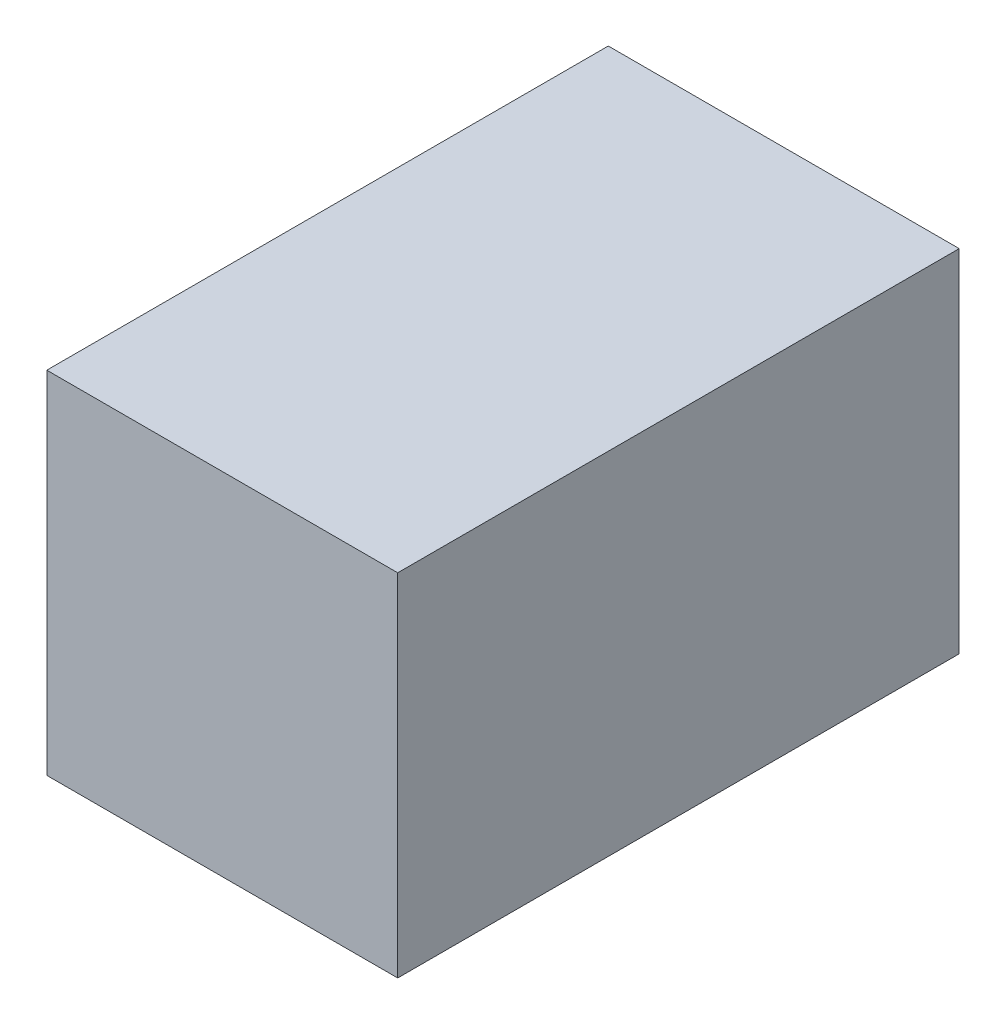
ISO-10303-21;
HEADER;
FILE_DESCRIPTION(('STEP AP214'),'2;1');
FILE_NAME('part.step','',(''),(''),'','','');
FILE_SCHEMA(('AUTOMOTIVE_DESIGN { 1 0 10303 214 1 1 1 1 }'));
ENDSEC;
DATA;
#1=APPLICATION_CONTEXT('core data for automotive mechanical design processes');
#2=APPLICATION_PROTOCOL_DEFINITION('international standard','automotive_design',2000,#1);
#3=PRODUCT_CONTEXT('',#1,'mechanical');
#4=PRODUCT('Part','Part','',(#3));
#5=PRODUCT_RELATED_PRODUCT_CATEGORY('part','',(#4));
#6=PRODUCT_DEFINITION_FORMATION('','',#4);
#7=PRODUCT_DEFINITION_CONTEXT('part definition',#1,'design');
#8=PRODUCT_DEFINITION('design','',#6,#7);
#9=PRODUCT_DEFINITION_SHAPE('','',#8);
#10=(LENGTH_UNIT() NAMED_UNIT(*) SI_UNIT(.MILLI.,.METRE.));
#11=(NAMED_UNIT(*) PLANE_ANGLE_UNIT() SI_UNIT($,.RADIAN.));
#12=(NAMED_UNIT(*) SI_UNIT($,.STERADIAN.) SOLID_ANGLE_UNIT());
#13=UNCERTAINTY_MEASURE_WITH_UNIT(LENGTH_MEASURE(1.E-05),#10,'distance_accuracy_value','');
#14=(GEOMETRIC_REPRESENTATION_CONTEXT(3) GLOBAL_UNCERTAINTY_ASSIGNED_CONTEXT((#13)) GLOBAL_UNIT_ASSIGNED_CONTEXT((#10,
#11,#12)) REPRESENTATION_CONTEXT('',''));
#15=CARTESIAN_POINT('',(0.,0.,0.));
#16=DIRECTION('',(0.,0.,1.));
#17=DIRECTION('',(1.,0.,0.));
#18=AXIS2_PLACEMENT_3D('',#15,#16,#17);
#19=CARTESIAN_POINT('',(0.5,1.,-0.800000000000001));
#20=DIRECTION('',(-1.,0.,0.));
#21=DIRECTION('',(0.,0.,1.));
#22=AXIS2_PLACEMENT_3D('',#19,#20,#21);
#23=PLANE('',#22);
#24=DIRECTION('',(0.,0.,-1.));
#25=VECTOR('',#24,1.);
#26=CARTESIAN_POINT('',(0.5,0.,-0.800000000000001));
#27=LINE('',#26,#25);
#28=CARTESIAN_POINT('',(0.5,0.,0.799999999999999));
#29=VERTEX_POINT('',#28);
#30=CARTESIAN_POINT('',(0.5,0.,-0.800000000000001));
#31=VERTEX_POINT('',#30);
#32=EDGE_CURVE('E98',#29,#31,#27,.T.);
#33=ORIENTED_EDGE('',*,*,#32,.T.);
#34=DIRECTION('',(0.,-1.,0.));
#35=VECTOR('',#34,1.);
#36=CARTESIAN_POINT('',(0.5,1.,-0.800000000000001));
#37=LINE('',#36,#35);
#38=CARTESIAN_POINT('',(0.5,1.,-0.800000000000001));
#39=VERTEX_POINT('',#38);
#40=EDGE_CURVE('E11',#39,#31,#37,.T.);
#41=ORIENTED_EDGE('',*,*,#40,.F.);
#42=DIRECTION('',(0.,0.,-1.));
#43=VECTOR('',#42,1.);
#44=CARTESIAN_POINT('',(0.5,1.,-0.800000000000001));
#45=LINE('',#44,#43);
#46=CARTESIAN_POINT('',(0.5,1.,0.799999999999999));
#47=VERTEX_POINT('',#46);
#48=EDGE_CURVE('E86',#47,#39,#45,.T.);
#49=ORIENTED_EDGE('',*,*,#48,.F.);
#50=DIRECTION('',(0.,-1.,0.));
#51=VECTOR('',#50,1.);
#52=CARTESIAN_POINT('',(0.5,1.,0.799999999999999));
#53=LINE('',#52,#51);
#54=EDGE_CURVE('E94',#47,#29,#53,.T.);
#55=ORIENTED_EDGE('',*,*,#54,.T.);
#56=EDGE_LOOP('',(#33,#41,#49,#55));
#57=FACE_BOUND('',#56,.T.);
#58=ADVANCED_FACE('F35',(#57),#23,.F.);
#59=CARTESIAN_POINT('',(-0.5,1.,-0.800000000000001));
#60=DIRECTION('',(0.,0.,1.));
#61=DIRECTION('',(1.,0.,0.));
#62=AXIS2_PLACEMENT_3D('',#59,#60,#61);
#63=PLANE('',#62);
#64=DIRECTION('',(-1.,0.,0.));
#65=VECTOR('',#64,1.);
#66=CARTESIAN_POINT('',(-0.5,0.,-0.800000000000001));
#67=LINE('',#66,#65);
#68=CARTESIAN_POINT('',(-0.5,0.,-0.800000000000001));
#69=VERTEX_POINT('',#68);
#70=EDGE_CURVE('E90',#31,#69,#67,.T.);
#71=ORIENTED_EDGE('',*,*,#70,.T.);
#72=DIRECTION('',(0.,-1.,0.));
#73=VECTOR('',#72,1.);
#74=CARTESIAN_POINT('',(-0.5,1.,-0.800000000000001));
#75=LINE('',#74,#73);
#76=CARTESIAN_POINT('',(-0.5,1.,-0.800000000000001));
#77=VERTEX_POINT('',#76);
#78=EDGE_CURVE('E43',#77,#69,#75,.T.);
#79=ORIENTED_EDGE('',*,*,#78,.F.);
#80=DIRECTION('',(-1.,0.,0.));
#81=VECTOR('',#80,1.);
#82=CARTESIAN_POINT('',(-0.5,1.,-0.800000000000001));
#83=LINE('',#82,#81);
#84=EDGE_CURVE('E81',#39,#77,#83,.T.);
#85=ORIENTED_EDGE('',*,*,#84,.F.);
#86=ORIENTED_EDGE('',*,*,#40,.T.);
#87=EDGE_LOOP('',(#71,#79,#85,#86));
#88=FACE_BOUND('',#87,.T.);
#89=ADVANCED_FACE('F89',(#88),#63,.F.);
#90=CARTESIAN_POINT('',(-0.5,1.,-0.800000000000001));
#91=DIRECTION('',(1.,0.,0.));
#92=DIRECTION('',(0.,0.,-1.));
#93=AXIS2_PLACEMENT_3D('',#90,#91,#92);
#94=PLANE('',#93);
#95=DIRECTION('',(0.,0.,1.));
#96=VECTOR('',#95,1.);
#97=CARTESIAN_POINT('',(-0.5,0.,-0.800000000000001));
#98=LINE('',#97,#96);
#99=CARTESIAN_POINT('',(-0.5,0.,0.799999999999999));
#100=VERTEX_POINT('',#99);
#101=EDGE_CURVE('E68',#69,#100,#98,.T.);
#102=ORIENTED_EDGE('',*,*,#101,.T.);
#103=DIRECTION('',(0.,-1.,0.));
#104=VECTOR('',#103,1.);
#105=CARTESIAN_POINT('',(-0.5,1.,0.799999999999999));
#106=LINE('',#105,#104);
#107=CARTESIAN_POINT('',(-0.5,1.,0.799999999999999));
#108=VERTEX_POINT('',#107);
#109=EDGE_CURVE('E91',#108,#100,#106,.T.);
#110=ORIENTED_EDGE('',*,*,#109,.F.);
#111=DIRECTION('',(0.,0.,1.));
#112=VECTOR('',#111,1.);
#113=CARTESIAN_POINT('',(-0.5,1.,-0.800000000000001));
#114=LINE('',#113,#112);
#115=EDGE_CURVE('E84',#77,#108,#114,.T.);
#116=ORIENTED_EDGE('',*,*,#115,.F.);
#117=ORIENTED_EDGE('',*,*,#78,.T.);
#118=EDGE_LOOP('',(#102,#110,#116,#117));
#119=FACE_BOUND('',#118,.T.);
#120=ADVANCED_FACE('F92',(#119),#94,.F.);
#121=CARTESIAN_POINT('',(-0.5,1.,0.799999999999999));
#122=DIRECTION('',(0.,0.,-1.));
#123=DIRECTION('',(-1.,0.,0.));
#124=AXIS2_PLACEMENT_3D('',#121,#122,#123);
#125=PLANE('',#124);
#126=DIRECTION('',(1.,0.,0.));
#127=VECTOR('',#126,1.);
#128=CARTESIAN_POINT('',(-0.5,0.,0.799999999999999));
#129=LINE('',#128,#127);
#130=EDGE_CURVE('E74',#100,#29,#129,.T.);
#131=ORIENTED_EDGE('',*,*,#130,.T.);
#132=ORIENTED_EDGE('',*,*,#54,.F.);
#133=DIRECTION('',(1.,0.,0.));
#134=VECTOR('',#133,1.);
#135=CARTESIAN_POINT('',(-0.5,1.,0.799999999999999));
#136=LINE('',#135,#134);
#137=EDGE_CURVE('E51',#108,#47,#136,.T.);
#138=ORIENTED_EDGE('',*,*,#137,.F.);
#139=ORIENTED_EDGE('',*,*,#109,.T.);
#140=EDGE_LOOP('',(#131,#132,#138,#139));
#141=FACE_BOUND('',#140,.T.);
#142=ADVANCED_FACE('F105',(#141),#125,.F.);
#143=CARTESIAN_POINT('',(0.,1.,0.));
#144=DIRECTION('',(0.,1.,0.));
#145=DIRECTION('',(0.,0.,1.));
#146=AXIS2_PLACEMENT_3D('',#143,#144,#145);
#147=PLANE('',#146);
#148=ORIENTED_EDGE('',*,*,#48,.T.);
#149=ORIENTED_EDGE('',*,*,#84,.T.);
#150=ORIENTED_EDGE('',*,*,#115,.T.);
#151=ORIENTED_EDGE('',*,*,#137,.T.);
#152=EDGE_LOOP('',(#148,#149,#150,#151));
#153=FACE_BOUND('',#152,.T.);
#154=ADVANCED_FACE('F82',(#153),#147,.T.);
#155=CARTESIAN_POINT('',(0.,0.,0.));
#156=DIRECTION('',(0.,1.,0.));
#157=DIRECTION('',(0.,0.,1.));
#158=AXIS2_PLACEMENT_3D('',#155,#156,#157);
#159=PLANE('',#158);
#160=ORIENTED_EDGE('',*,*,#32,.F.);
#161=ORIENTED_EDGE('',*,*,#130,.F.);
#162=ORIENTED_EDGE('',*,*,#101,.F.);
#163=ORIENTED_EDGE('',*,*,#70,.F.);
#164=EDGE_LOOP('',(#160,#161,#162,#163));
#165=FACE_BOUND('',#164,.T.);
#166=ADVANCED_FACE('F108',(#165),#159,.F.);
#167=CLOSED_SHELL('',(#58,#89,#120,#142,#154,#166));
#168=MANIFOLD_SOLID_BREP('B2',#167);
#169=ADVANCED_BREP_SHAPE_REPRESENTATION('',(#18,#168),#14);
#170=SHAPE_DEFINITION_REPRESENTATION(#9,#169);
ENDSEC;
END-ISO-10303-21;
